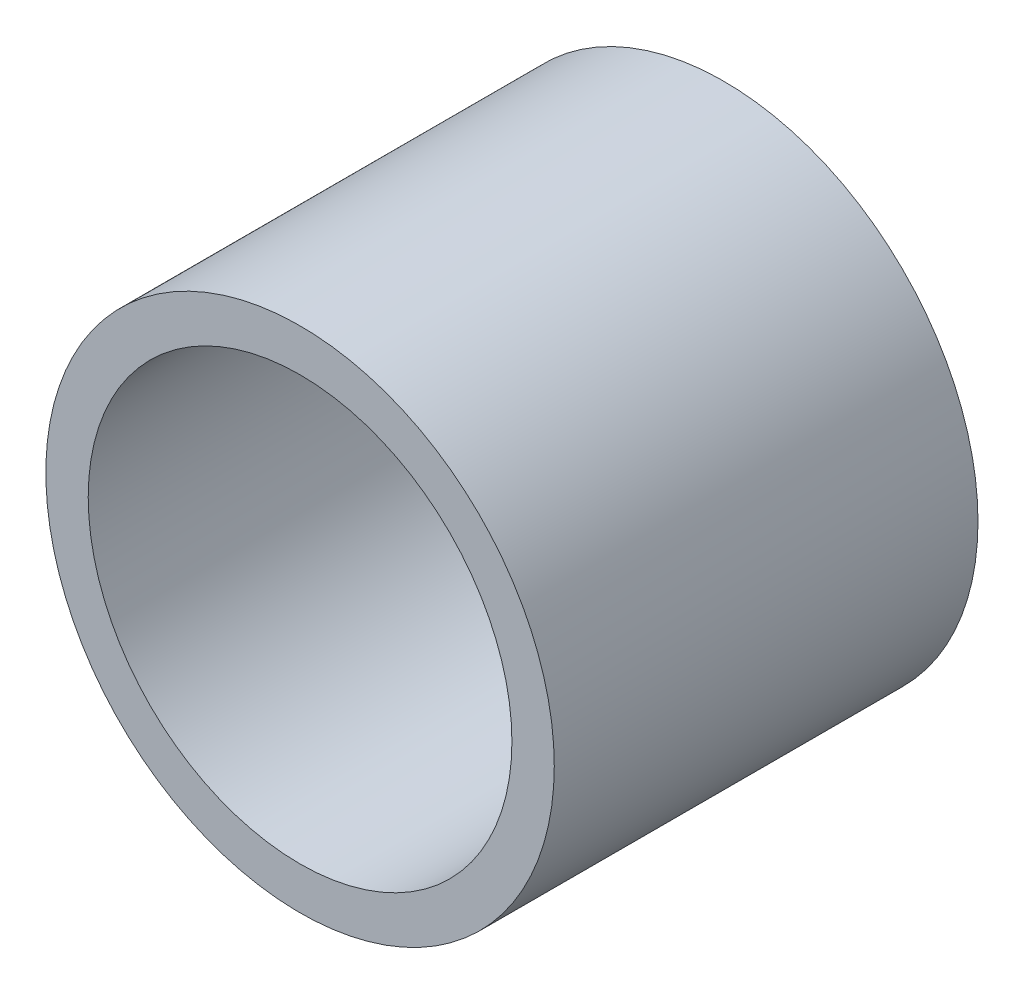
ISO-10303-21;
HEADER;
FILE_DESCRIPTION(('STEP AP214'),'2;1');
FILE_NAME('part.step','',(''),(''),'','','');
FILE_SCHEMA(('AUTOMOTIVE_DESIGN { 1 0 10303 214 1 1 1 1 }'));
ENDSEC;
DATA;
#1=APPLICATION_CONTEXT('core data for automotive mechanical design processes');
#2=APPLICATION_PROTOCOL_DEFINITION('international standard','automotive_design',2000,#1);
#3=PRODUCT_CONTEXT('',#1,'mechanical');
#4=PRODUCT('Part','Part','',(#3));
#5=PRODUCT_RELATED_PRODUCT_CATEGORY('part','',(#4));
#6=PRODUCT_DEFINITION_FORMATION('','',#4);
#7=PRODUCT_DEFINITION_CONTEXT('part definition',#1,'design');
#8=PRODUCT_DEFINITION('design','',#6,#7);
#9=PRODUCT_DEFINITION_SHAPE('','',#8);
#10=(LENGTH_UNIT() NAMED_UNIT(*) SI_UNIT(.MILLI.,.METRE.));
#11=(NAMED_UNIT(*) PLANE_ANGLE_UNIT() SI_UNIT($,.RADIAN.));
#12=(NAMED_UNIT(*) SI_UNIT($,.STERADIAN.) SOLID_ANGLE_UNIT());
#13=UNCERTAINTY_MEASURE_WITH_UNIT(LENGTH_MEASURE(1.E-05),#10,'distance_accuracy_value','');
#14=(GEOMETRIC_REPRESENTATION_CONTEXT(3) GLOBAL_UNCERTAINTY_ASSIGNED_CONTEXT((#13)) GLOBAL_UNIT_ASSIGNED_CONTEXT((#10,
#11,#12)) REPRESENTATION_CONTEXT('',''));
#15=CARTESIAN_POINT('',(0.,0.,0.));
#16=DIRECTION('',(0.,0.,1.));
#17=DIRECTION('',(1.,0.,0.));
#18=AXIS2_PLACEMENT_3D('',#15,#16,#17);
#19=CARTESIAN_POINT('',(0.,0.,-10.));
#20=DIRECTION('',(0.,0.,1.));
#21=DIRECTION('',(1.,0.,0.));
#22=AXIS2_PLACEMENT_3D('',#19,#20,#21);
#23=CYLINDRICAL_SURFACE('',#22,5.);
#24=CARTESIAN_POINT('',(0.,0.,-10.));
#25=DIRECTION('',(0.,0.,1.));
#26=DIRECTION('',(1.,0.,0.));
#27=AXIS2_PLACEMENT_3D('',#24,#25,#26);
#28=CIRCLE('',#27,5.);
#29=CARTESIAN_POINT('',(5.,0.,-10.));
#30=VERTEX_POINT('',#29);
#31=EDGE_CURVE('E12',#30,#30,#28,.T.);
#32=ORIENTED_EDGE('',*,*,#31,.T.);
#33=EDGE_LOOP('',(#32));
#34=FACE_BOUND('',#33,.T.);
#35=CARTESIAN_POINT('',(0.,0.,0.));
#36=DIRECTION('',(0.,0.,1.));
#37=DIRECTION('',(1.,0.,0.));
#38=AXIS2_PLACEMENT_3D('',#35,#36,#37);
#39=CIRCLE('',#38,5.);
#40=CARTESIAN_POINT('',(5.,0.,0.));
#41=VERTEX_POINT('',#40);
#42=EDGE_CURVE('E48',#41,#41,#39,.T.);
#43=ORIENTED_EDGE('',*,*,#42,.F.);
#44=EDGE_LOOP('',(#43));
#45=FACE_BOUND('',#44,.T.);
#46=ADVANCED_FACE('F45',(#34,#45),#23,.T.);
#47=CARTESIAN_POINT('',(0.,0.,-10.));
#48=DIRECTION('',(0.,0.,1.));
#49=DIRECTION('',(1.,0.,0.));
#50=AXIS2_PLACEMENT_3D('',#47,#48,#49);
#51=PLANE('',#50);
#52=ORIENTED_EDGE('',*,*,#31,.F.);
#53=EDGE_LOOP('',(#52));
#54=FACE_BOUND('',#53,.T.);
#55=ADVANCED_FACE('F60',(#54),#51,.F.);
#56=CARTESIAN_POINT('',(0.,0.,0.));
#57=DIRECTION('',(0.,0.,1.));
#58=DIRECTION('',(1.,0.,0.));
#59=AXIS2_PLACEMENT_3D('',#56,#57,#58);
#60=PLANE('',#59);
#61=ORIENTED_EDGE('',*,*,#42,.T.);
#62=EDGE_LOOP('',(#61));
#63=FACE_BOUND('',#62,.T.);
#64=ADVANCED_FACE('F57',(#63),#60,.T.);
#65=CLOSED_SHELL('',(#46,#55,#64));
#66=MANIFOLD_SOLID_BREP('B2',#65);
#67=CARTESIAN_POINT('',(0.,0.,15.));
#68=DIRECTION('',(0.,0.,1.));
#69=DIRECTION('',(1.,0.,0.));
#70=AXIS2_PLACEMENT_3D('',#67,#68,#69);
#71=PLANE('',#70);
#72=CARTESIAN_POINT('',(0.,0.,15.));
#73=DIRECTION('',(0.,0.,1.));
#74=DIRECTION('',(1.,0.,0.));
#75=AXIS2_PLACEMENT_3D('',#72,#73,#74);
#76=CIRCLE('',#75,18.);
#77=CARTESIAN_POINT('',(18.,0.,15.));
#78=VERTEX_POINT('',#77);
#79=EDGE_CURVE('E44',#78,#78,#76,.T.);
#80=ORIENTED_EDGE('',*,*,#79,.T.);
#81=EDGE_LOOP('',(#80));
#82=FACE_BOUND('',#81,.T.);
#83=CARTESIAN_POINT('',(0.,0.,15.));
#84=DIRECTION('',(0.,0.,1.));
#85=DIRECTION('',(1.,0.,0.));
#86=AXIS2_PLACEMENT_3D('',#83,#84,#85);
#87=CIRCLE('',#86,15.);
#88=CARTESIAN_POINT('',(15.,0.,15.));
#89=VERTEX_POINT('',#88);
#90=EDGE_CURVE('E97',#89,#89,#87,.T.);
#91=ORIENTED_EDGE('',*,*,#90,.F.);
#92=EDGE_LOOP('',(#91));
#93=FACE_BOUND('',#92,.T.);
#94=ADVANCED_FACE('F86',(#82,#93),#71,.T.);
#95=CARTESIAN_POINT('',(0.,0.,-15.));
#96=DIRECTION('',(0.,0.,1.));
#97=DIRECTION('',(1.,0.,0.));
#98=AXIS2_PLACEMENT_3D('',#95,#96,#97);
#99=PLANE('',#98);
#100=CARTESIAN_POINT('',(0.,0.,-15.));
#101=DIRECTION('',(0.,0.,1.));
#102=DIRECTION('',(1.,0.,0.));
#103=AXIS2_PLACEMENT_3D('',#100,#101,#102);
#104=CIRCLE('',#103,18.);
#105=CARTESIAN_POINT('',(18.,0.,-15.));
#106=VERTEX_POINT('',#105);
#107=EDGE_CURVE('E90',#106,#106,#104,.T.);
#108=ORIENTED_EDGE('',*,*,#107,.F.);
#109=EDGE_LOOP('',(#108));
#110=FACE_BOUND('',#109,.T.);
#111=CARTESIAN_POINT('',(0.,0.,-15.));
#112=DIRECTION('',(0.,0.,1.));
#113=DIRECTION('',(1.,0.,0.));
#114=AXIS2_PLACEMENT_3D('',#111,#112,#113);
#115=CIRCLE('',#114,15.);
#116=CARTESIAN_POINT('',(15.,0.,-15.));
#117=VERTEX_POINT('',#116);
#118=EDGE_CURVE('E99',#117,#117,#115,.T.);
#119=ORIENTED_EDGE('',*,*,#118,.T.);
#120=EDGE_LOOP('',(#119));
#121=FACE_BOUND('',#120,.T.);
#122=ADVANCED_FACE('F109',(#110,#121),#99,.F.);
#123=CARTESIAN_POINT('',(0.,0.,15.));
#124=DIRECTION('',(0.,0.,-1.));
#125=DIRECTION('',(-1.,0.,0.));
#126=AXIS2_PLACEMENT_3D('',#123,#124,#125);
#127=CYLINDRICAL_SURFACE('',#126,18.);
#128=ORIENTED_EDGE('',*,*,#79,.F.);
#129=EDGE_LOOP('',(#128));
#130=FACE_BOUND('',#129,.T.);
#131=ORIENTED_EDGE('',*,*,#107,.T.);
#132=EDGE_LOOP('',(#131));
#133=FACE_BOUND('',#132,.T.);
#134=ADVANCED_FACE('F88',(#130,#133),#127,.T.);
#135=CARTESIAN_POINT('',(0.,0.,15.));
#136=DIRECTION('',(0.,0.,-1.));
#137=DIRECTION('',(-1.,0.,0.));
#138=AXIS2_PLACEMENT_3D('',#135,#136,#137);
#139=CYLINDRICAL_SURFACE('',#138,15.);
#140=ORIENTED_EDGE('',*,*,#90,.T.);
#141=EDGE_LOOP('',(#140));
#142=FACE_BOUND('',#141,.T.);
#143=ORIENTED_EDGE('',*,*,#118,.F.);
#144=EDGE_LOOP('',(#143));
#145=FACE_BOUND('',#144,.T.);
#146=ADVANCED_FACE('F105',(#142,#145),#139,.F.);
#147=CLOSED_SHELL('',(#94,#122,#134,#146));
#148=MANIFOLD_SOLID_BREP('B7',#147);
#149=ADVANCED_BREP_SHAPE_REPRESENTATION('',(#18,#66,#148),#14);
#150=SHAPE_DEFINITION_REPRESENTATION(#9,#149);
ENDSEC;
END-ISO-10303-21;
